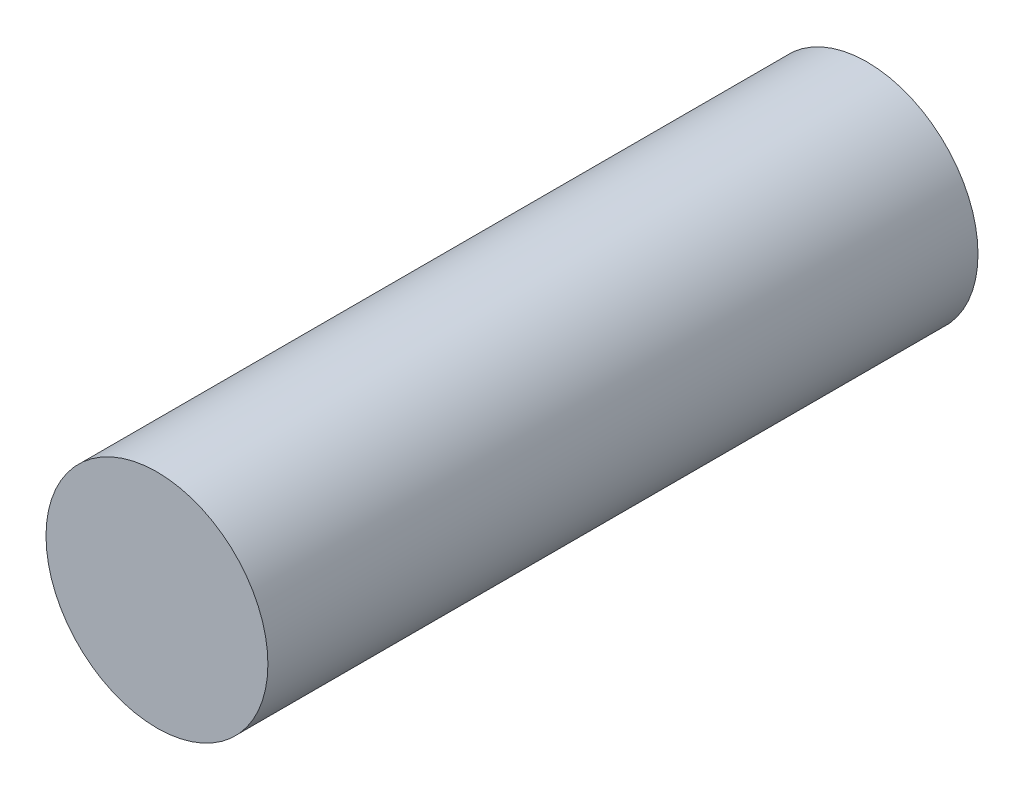
ISO-10303-21;
HEADER;
FILE_DESCRIPTION(('STEP AP214'),'2;1');
FILE_NAME('part.step','',(''),(''),'','','');
FILE_SCHEMA(('AUTOMOTIVE_DESIGN { 1 0 10303 214 1 1 1 1 }'));
ENDSEC;
DATA;
#1=APPLICATION_CONTEXT('core data for automotive mechanical design processes');
#2=APPLICATION_PROTOCOL_DEFINITION('international standard','automotive_design',2000,#1);
#3=PRODUCT_CONTEXT('',#1,'mechanical');
#4=PRODUCT('Part','Part','',(#3));
#5=PRODUCT_RELATED_PRODUCT_CATEGORY('part','',(#4));
#6=PRODUCT_DEFINITION_FORMATION('','',#4);
#7=PRODUCT_DEFINITION_CONTEXT('part definition',#1,'design');
#8=PRODUCT_DEFINITION('design','',#6,#7);
#9=PRODUCT_DEFINITION_SHAPE('','',#8);
#10=(LENGTH_UNIT() NAMED_UNIT(*) SI_UNIT(.MILLI.,.METRE.));
#11=(NAMED_UNIT(*) PLANE_ANGLE_UNIT() SI_UNIT($,.RADIAN.));
#12=(NAMED_UNIT(*) SI_UNIT($,.STERADIAN.) SOLID_ANGLE_UNIT());
#13=UNCERTAINTY_MEASURE_WITH_UNIT(LENGTH_MEASURE(1.E-05),#10,'distance_accuracy_value','');
#14=(GEOMETRIC_REPRESENTATION_CONTEXT(3) GLOBAL_UNCERTAINTY_ASSIGNED_CONTEXT((#13)) GLOBAL_UNIT_ASSIGNED_CONTEXT((#10,
#11,#12)) REPRESENTATION_CONTEXT('',''));
#15=CARTESIAN_POINT('',(0.,0.,0.));
#16=DIRECTION('',(0.,0.,1.));
#17=DIRECTION('',(1.,0.,0.));
#18=AXIS2_PLACEMENT_3D('',#15,#16,#17);
#19=CARTESIAN_POINT('',(0.,0.,25.4));
#20=DIRECTION('',(0.,0.,-1.));
#21=DIRECTION('',(-1.,0.,0.));
#22=AXIS2_PLACEMENT_3D('',#19,#20,#21);
#23=CYLINDRICAL_SURFACE('',#22,3.96875);
#24=CARTESIAN_POINT('',(0.,0.,25.4));
#25=DIRECTION('',(0.,0.,1.));
#26=DIRECTION('',(1.,0.,0.));
#27=AXIS2_PLACEMENT_3D('',#24,#25,#26);
#28=CIRCLE('',#27,3.96875);
#29=CARTESIAN_POINT('',(3.96875,0.,25.4));
#30=VERTEX_POINT('',#29);
#31=EDGE_CURVE('E10',#30,#30,#28,.T.);
#32=ORIENTED_EDGE('',*,*,#31,.F.);
#33=EDGE_LOOP('',(#32));
#34=FACE_BOUND('',#33,.T.);
#35=CARTESIAN_POINT('',(0.,0.,0.));
#36=DIRECTION('',(0.,0.,1.));
#37=DIRECTION('',(1.,0.,0.));
#38=AXIS2_PLACEMENT_3D('',#35,#36,#37);
#39=CIRCLE('',#38,3.96875);
#40=CARTESIAN_POINT('',(3.96875,0.,0.));
#41=VERTEX_POINT('',#40);
#42=EDGE_CURVE('E33',#41,#41,#39,.T.);
#43=ORIENTED_EDGE('',*,*,#42,.T.);
#44=EDGE_LOOP('',(#43));
#45=FACE_BOUND('',#44,.T.);
#46=ADVANCED_FACE('F30',(#34,#45),#23,.T.);
#47=CARTESIAN_POINT('',(0.,0.,25.4));
#48=DIRECTION('',(0.,0.,1.));
#49=DIRECTION('',(1.,0.,0.));
#50=AXIS2_PLACEMENT_3D('',#47,#48,#49);
#51=PLANE('',#50);
#52=ORIENTED_EDGE('',*,*,#31,.T.);
#53=EDGE_LOOP('',(#52));
#54=FACE_BOUND('',#53,.T.);
#55=ADVANCED_FACE('F45',(#54),#51,.T.);
#56=CARTESIAN_POINT('',(0.,0.,0.));
#57=DIRECTION('',(0.,0.,1.));
#58=DIRECTION('',(1.,0.,0.));
#59=AXIS2_PLACEMENT_3D('',#56,#57,#58);
#60=PLANE('',#59);
#61=ORIENTED_EDGE('',*,*,#42,.F.);
#62=EDGE_LOOP('',(#61));
#63=FACE_BOUND('',#62,.T.);
#64=ADVANCED_FACE('F43',(#63),#60,.F.);
#65=CLOSED_SHELL('',(#46,#55,#64));
#66=MANIFOLD_SOLID_BREP('B2',#65);
#67=ADVANCED_BREP_SHAPE_REPRESENTATION('',(#18,#66),#14);
#68=SHAPE_DEFINITION_REPRESENTATION(#9,#67);
ENDSEC;
END-ISO-10303-21;
